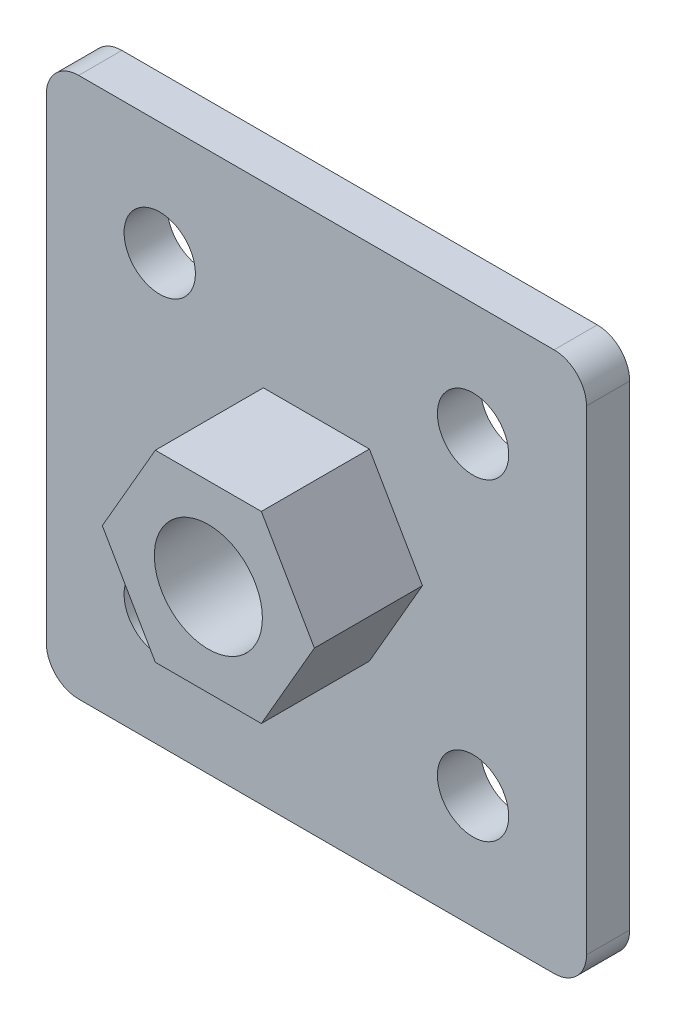
ISO-10303-21;
HEADER;
FILE_DESCRIPTION(('STEP AP214'),'2;1');
FILE_NAME('part.step','',(''),(''),'','','');
FILE_SCHEMA(('AUTOMOTIVE_DESIGN { 1 0 10303 214 1 1 1 1 }'));
ENDSEC;
DATA;
#1=APPLICATION_CONTEXT('core data for automotive mechanical design processes');
#2=APPLICATION_PROTOCOL_DEFINITION('international standard','automotive_design',2000,#1);
#3=PRODUCT_CONTEXT('',#1,'mechanical');
#4=PRODUCT('Part','Part','',(#3));
#5=PRODUCT_RELATED_PRODUCT_CATEGORY('part','',(#4));
#6=PRODUCT_DEFINITION_FORMATION('','',#4);
#7=PRODUCT_DEFINITION_CONTEXT('part definition',#1,'design');
#8=PRODUCT_DEFINITION('design','',#6,#7);
#9=PRODUCT_DEFINITION_SHAPE('','',#8);
#10=(LENGTH_UNIT() NAMED_UNIT(*) SI_UNIT(.MILLI.,.METRE.));
#11=(NAMED_UNIT(*) PLANE_ANGLE_UNIT() SI_UNIT($,.RADIAN.));
#12=(NAMED_UNIT(*) SI_UNIT($,.STERADIAN.) SOLID_ANGLE_UNIT());
#13=UNCERTAINTY_MEASURE_WITH_UNIT(LENGTH_MEASURE(1.E-05),#10,'distance_accuracy_value','');
#14=(GEOMETRIC_REPRESENTATION_CONTEXT(3) GLOBAL_UNCERTAINTY_ASSIGNED_CONTEXT((#13)) GLOBAL_UNIT_ASSIGNED_CONTEXT((#10,
#11,#12)) REPRESENTATION_CONTEXT('',''));
#15=CARTESIAN_POINT('',(0.,0.,0.));
#16=DIRECTION('',(0.,0.,1.));
#17=DIRECTION('',(1.,0.,0.));
#18=AXIS2_PLACEMENT_3D('',#15,#16,#17);
#19=CARTESIAN_POINT('',(0.,0.,4.));
#20=DIRECTION('',(0.,0.,-1.));
#21=DIRECTION('',(-1.,0.,0.));
#22=AXIS2_PLACEMENT_3D('',#19,#20,#21);
#23=PLANE('',#22);
#24=DIRECTION('',(-1.,0.,0.));
#25=VECTOR('',#24,1.);
#26=CARTESIAN_POINT('',(-25.,25.,4.));
#27=LINE('',#26,#25);
#28=CARTESIAN_POINT('',(22.,25.,4.));
#29=VERTEX_POINT('',#28);
#30=CARTESIAN_POINT('',(-22.,25.,4.));
#31=VERTEX_POINT('',#30);
#32=EDGE_CURVE('E217',#29,#31,#27,.T.);
#33=ORIENTED_EDGE('',*,*,#32,.T.);
#34=CARTESIAN_POINT('',(-22.,22.,4.));
#35=DIRECTION('',(0.,0.,-1.));
#36=DIRECTION('',(-1.,0.,0.));
#37=AXIS2_PLACEMENT_3D('',#34,#35,#36);
#38=CIRCLE('',#37,3.);
#39=CARTESIAN_POINT('',(-25.,22.,4.));
#40=VERTEX_POINT('',#39);
#41=EDGE_CURVE('E279',#31,#40,#38,.F.);
#42=ORIENTED_EDGE('',*,*,#41,.T.);
#43=DIRECTION('',(0.,-1.,0.));
#44=VECTOR('',#43,1.);
#45=CARTESIAN_POINT('',(-25.,-25.,4.));
#46=LINE('',#45,#44);
#47=CARTESIAN_POINT('',(-25.,-22.,4.));
#48=VERTEX_POINT('',#47);
#49=EDGE_CURVE('E222',#40,#48,#46,.T.);
#50=ORIENTED_EDGE('',*,*,#49,.T.);
#51=CARTESIAN_POINT('',(-22.,-22.,4.));
#52=DIRECTION('',(0.,0.,-1.));
#53=DIRECTION('',(-1.,0.,0.));
#54=AXIS2_PLACEMENT_3D('',#51,#52,#53);
#55=CIRCLE('',#54,3.);
#56=CARTESIAN_POINT('',(-22.,-25.,4.));
#57=VERTEX_POINT('',#56);
#58=EDGE_CURVE('E273',#48,#57,#55,.F.);
#59=ORIENTED_EDGE('',*,*,#58,.T.);
#60=DIRECTION('',(1.,0.,0.));
#61=VECTOR('',#60,1.);
#62=CARTESIAN_POINT('',(-25.,-25.,4.));
#63=LINE('',#62,#61);
#64=CARTESIAN_POINT('',(22.,-25.,4.));
#65=VERTEX_POINT('',#64);
#66=EDGE_CURVE('E226',#57,#65,#63,.T.);
#67=ORIENTED_EDGE('',*,*,#66,.T.);
#68=CARTESIAN_POINT('',(22.,-22.,4.));
#69=DIRECTION('',(0.,0.,-1.));
#70=DIRECTION('',(-1.,0.,0.));
#71=AXIS2_PLACEMENT_3D('',#68,#69,#70);
#72=CIRCLE('',#71,3.);
#73=CARTESIAN_POINT('',(25.,-22.,4.));
#74=VERTEX_POINT('',#73);
#75=EDGE_CURVE('E270',#65,#74,#72,.F.);
#76=ORIENTED_EDGE('',*,*,#75,.T.);
#77=DIRECTION('',(0.,1.,0.));
#78=VECTOR('',#77,1.);
#79=CARTESIAN_POINT('',(25.,-25.,4.));
#80=LINE('',#79,#78);
#81=CARTESIAN_POINT('',(25.,22.,4.));
#82=VERTEX_POINT('',#81);
#83=EDGE_CURVE('E213',#74,#82,#80,.T.);
#84=ORIENTED_EDGE('',*,*,#83,.T.);
#85=CARTESIAN_POINT('',(22.,22.,4.));
#86=DIRECTION('',(0.,0.,-1.));
#87=DIRECTION('',(-1.,0.,0.));
#88=AXIS2_PLACEMENT_3D('',#85,#86,#87);
#89=CIRCLE('',#88,3.);
#90=EDGE_CURVE('E276',#82,#29,#89,.F.);
#91=ORIENTED_EDGE('',*,*,#90,.T.);
#92=EDGE_LOOP('',(#33,#42,#50,#59,#67,#76,#84,#91));
#93=FACE_BOUND('',#92,.T.);
#94=CARTESIAN_POINT('',(-14.5,-14.5,4.));
#95=DIRECTION('',(0.,0.,-1.));
#96=DIRECTION('',(0.,1.,0.));
#97=AXIS2_PLACEMENT_3D('',#94,#95,#96);
#98=CIRCLE('',#97,3.3);
#99=CARTESIAN_POINT('',(-14.5,-11.2,4.));
#100=VERTEX_POINT('',#99);
#101=EDGE_CURVE('E204',#100,#100,#98,.T.);
#102=ORIENTED_EDGE('',*,*,#101,.T.);
#103=EDGE_LOOP('',(#102));
#104=FACE_BOUND('',#103,.T.);
#105=CARTESIAN_POINT('',(14.5,-14.5,4.));
#106=DIRECTION('',(0.,0.,-1.));
#107=DIRECTION('',(0.,1.,0.));
#108=AXIS2_PLACEMENT_3D('',#105,#106,#107);
#109=CIRCLE('',#108,3.3);
#110=CARTESIAN_POINT('',(14.5,-11.2,4.));
#111=VERTEX_POINT('',#110);
#112=EDGE_CURVE('E196',#111,#111,#109,.T.);
#113=ORIENTED_EDGE('',*,*,#112,.T.);
#114=EDGE_LOOP('',(#113));
#115=FACE_BOUND('',#114,.T.);
#116=CARTESIAN_POINT('',(-14.5,14.5,4.));
#117=DIRECTION('',(0.,0.,-1.));
#118=DIRECTION('',(0.,1.,0.));
#119=AXIS2_PLACEMENT_3D('',#116,#117,#118);
#120=CIRCLE('',#119,3.3);
#121=CARTESIAN_POINT('',(-14.5,17.8,4.));
#122=VERTEX_POINT('',#121);
#123=EDGE_CURVE('E188',#122,#122,#120,.T.);
#124=ORIENTED_EDGE('',*,*,#123,.T.);
#125=EDGE_LOOP('',(#124));
#126=FACE_BOUND('',#125,.T.);
#127=CARTESIAN_POINT('',(14.5,14.5,4.));
#128=DIRECTION('',(0.,0.,-1.));
#129=DIRECTION('',(0.,1.,0.));
#130=AXIS2_PLACEMENT_3D('',#127,#128,#129);
#131=CIRCLE('',#130,3.3);
#132=CARTESIAN_POINT('',(14.5,17.8,4.));
#133=VERTEX_POINT('',#132);
#134=EDGE_CURVE('E180',#133,#133,#131,.T.);
#135=ORIENTED_EDGE('',*,*,#134,.T.);
#136=EDGE_LOOP('',(#135));
#137=FACE_BOUND('',#136,.T.);
#138=DIRECTION('',(1.,0.,0.));
#139=VECTOR('',#138,1.);
#140=CARTESIAN_POINT('',(-4.90747728811182,-8.5,4.));
#141=LINE('',#140,#139);
#142=CARTESIAN_POINT('',(-4.90747728811182,-8.5,4.));
#143=VERTEX_POINT('',#142);
#144=CARTESIAN_POINT('',(4.90747728811182,-8.5,4.));
#145=VERTEX_POINT('',#144);
#146=EDGE_CURVE('E164',#143,#145,#141,.T.);
#147=ORIENTED_EDGE('',*,*,#146,.F.);
#148=DIRECTION('',(0.5,-0.866025403784438,0.));
#149=VECTOR('',#148,1.);
#150=CARTESIAN_POINT('',(-9.81495457622364,0.,4.));
#151=LINE('',#150,#149);
#152=CARTESIAN_POINT('',(-9.81495457622364,0.,4.));
#153=VERTEX_POINT('',#152);
#154=EDGE_CURVE('E161',#153,#143,#151,.T.);
#155=ORIENTED_EDGE('',*,*,#154,.F.);
#156=DIRECTION('',(-0.5,-0.866025403784439,0.));
#157=VECTOR('',#156,1.);
#158=CARTESIAN_POINT('',(-4.90747728811182,8.50000000000001,4.));
#159=LINE('',#158,#157);
#160=CARTESIAN_POINT('',(-4.90747728811182,8.50000000000001,4.));
#161=VERTEX_POINT('',#160);
#162=EDGE_CURVE('E433',#161,#153,#159,.T.);
#163=ORIENTED_EDGE('',*,*,#162,.F.);
#164=DIRECTION('',(-1.,0.,0.));
#165=VECTOR('',#164,1.);
#166=CARTESIAN_POINT('',(4.90747728811182,8.50000000000001,4.));
#167=LINE('',#166,#165);
#168=CARTESIAN_POINT('',(4.90747728811182,8.50000000000001,4.));
#169=VERTEX_POINT('',#168);
#170=EDGE_CURVE('E453',#169,#161,#167,.T.);
#171=ORIENTED_EDGE('',*,*,#170,.F.);
#172=DIRECTION('',(-0.5,0.866025403784438,0.));
#173=VECTOR('',#172,1.);
#174=CARTESIAN_POINT('',(9.81495457622364,0.,4.));
#175=LINE('',#174,#173);
#176=CARTESIAN_POINT('',(9.81495457622364,0.,4.));
#177=VERTEX_POINT('',#176);
#178=EDGE_CURVE('E60',#177,#169,#175,.T.);
#179=ORIENTED_EDGE('',*,*,#178,.F.);
#180=DIRECTION('',(0.5,0.866025403784439,0.));
#181=VECTOR('',#180,1.);
#182=CARTESIAN_POINT('',(4.90747728811182,-8.5,4.));
#183=LINE('',#182,#181);
#184=EDGE_CURVE('E55',#145,#177,#183,.T.);
#185=ORIENTED_EDGE('',*,*,#184,.F.);
#186=EDGE_LOOP('',(#147,#155,#163,#171,#179,#185));
#187=FACE_BOUND('',#186,.T.);
#188=ADVANCED_FACE('F39',(#93,#104,#115,#126,#137,#187),#23,.F.);
#189=CARTESIAN_POINT('',(25.,-25.,4.));
#190=DIRECTION('',(-1.,0.,0.));
#191=DIRECTION('',(0.,0.,1.));
#192=AXIS2_PLACEMENT_3D('',#189,#190,#191);
#193=PLANE('',#192);
#194=DIRECTION('',(0.,1.,0.));
#195=VECTOR('',#194,1.);
#196=CARTESIAN_POINT('',(25.,-25.,0.));
#197=LINE('',#196,#195);
#198=CARTESIAN_POINT('',(25.,-22.,0.));
#199=VERTEX_POINT('',#198);
#200=CARTESIAN_POINT('',(25.,22.,0.));
#201=VERTEX_POINT('',#200);
#202=EDGE_CURVE('E212',#199,#201,#197,.T.);
#203=ORIENTED_EDGE('',*,*,#202,.T.);
#204=DIRECTION('',(0.,0.,-1.));
#205=VECTOR('',#204,1.);
#206=CARTESIAN_POINT('',(25.,22.,4.));
#207=LINE('',#206,#205);
#208=EDGE_CURVE('E286',#201,#82,#207,.F.);
#209=ORIENTED_EDGE('',*,*,#208,.T.);
#210=ORIENTED_EDGE('',*,*,#83,.F.);
#211=DIRECTION('',(0.,0.,-1.));
#212=VECTOR('',#211,1.);
#213=CARTESIAN_POINT('',(25.,-22.,4.));
#214=LINE('',#213,#212);
#215=EDGE_CURVE('E282',#74,#199,#214,.T.);
#216=ORIENTED_EDGE('',*,*,#215,.T.);
#217=EDGE_LOOP('',(#203,#209,#210,#216));
#218=FACE_BOUND('',#217,.T.);
#219=ADVANCED_FACE('F304',(#218),#193,.F.);
#220=CARTESIAN_POINT('',(-25.,25.,4.));
#221=DIRECTION('',(0.,-1.,0.));
#222=DIRECTION('',(0.,0.,-1.));
#223=AXIS2_PLACEMENT_3D('',#220,#221,#222);
#224=PLANE('',#223);
#225=DIRECTION('',(-1.,0.,0.));
#226=VECTOR('',#225,1.);
#227=CARTESIAN_POINT('',(-25.,25.,0.));
#228=LINE('',#227,#226);
#229=CARTESIAN_POINT('',(22.,25.,0.));
#230=VERTEX_POINT('',#229);
#231=CARTESIAN_POINT('',(-22.,25.,0.));
#232=VERTEX_POINT('',#231);
#233=EDGE_CURVE('E234',#230,#232,#228,.T.);
#234=ORIENTED_EDGE('',*,*,#233,.T.);
#235=DIRECTION('',(0.,0.,-1.));
#236=VECTOR('',#235,1.);
#237=CARTESIAN_POINT('',(-22.,25.,4.));
#238=LINE('',#237,#236);
#239=EDGE_CURVE('E267',#232,#31,#238,.F.);
#240=ORIENTED_EDGE('',*,*,#239,.T.);
#241=ORIENTED_EDGE('',*,*,#32,.F.);
#242=DIRECTION('',(0.,0.,-1.));
#243=VECTOR('',#242,1.);
#244=CARTESIAN_POINT('',(22.,25.,4.));
#245=LINE('',#244,#243);
#246=EDGE_CURVE('E263',#29,#230,#245,.T.);
#247=ORIENTED_EDGE('',*,*,#246,.T.);
#248=EDGE_LOOP('',(#234,#240,#241,#247));
#249=FACE_BOUND('',#248,.T.);
#250=ADVANCED_FACE('F316',(#249),#224,.F.);
#251=CARTESIAN_POINT('',(-25.,-25.,4.));
#252=DIRECTION('',(1.,0.,0.));
#253=DIRECTION('',(0.,0.,-1.));
#254=AXIS2_PLACEMENT_3D('',#251,#252,#253);
#255=PLANE('',#254);
#256=ORIENTED_EDGE('',*,*,#49,.F.);
#257=DIRECTION('',(0.,0.,-1.));
#258=VECTOR('',#257,1.);
#259=CARTESIAN_POINT('',(-25.,22.,4.));
#260=LINE('',#259,#258);
#261=CARTESIAN_POINT('',(-25.,22.,0.));
#262=VERTEX_POINT('',#261);
#263=EDGE_CURVE('E247',#40,#262,#260,.T.);
#264=ORIENTED_EDGE('',*,*,#263,.T.);
#265=DIRECTION('',(0.,-1.,0.));
#266=VECTOR('',#265,1.);
#267=CARTESIAN_POINT('',(-25.,-25.,0.));
#268=LINE('',#267,#266);
#269=CARTESIAN_POINT('',(-25.,-22.,0.));
#270=VERTEX_POINT('',#269);
#271=EDGE_CURVE('E238',#262,#270,#268,.T.);
#272=ORIENTED_EDGE('',*,*,#271,.T.);
#273=DIRECTION('',(0.,0.,-1.));
#274=VECTOR('',#273,1.);
#275=CARTESIAN_POINT('',(-25.,-22.,4.));
#276=LINE('',#275,#274);
#277=EDGE_CURVE('E230',#270,#48,#276,.F.);
#278=ORIENTED_EDGE('',*,*,#277,.T.);
#279=EDGE_LOOP('',(#256,#264,#272,#278));
#280=FACE_BOUND('',#279,.T.);
#281=ADVANCED_FACE('F324',(#280),#255,.F.);
#282=CARTESIAN_POINT('',(-25.,-25.,4.));
#283=DIRECTION('',(0.,1.,0.));
#284=DIRECTION('',(0.,0.,1.));
#285=AXIS2_PLACEMENT_3D('',#282,#283,#284);
#286=PLANE('',#285);
#287=ORIENTED_EDGE('',*,*,#66,.F.);
#288=DIRECTION('',(0.,0.,-1.));
#289=VECTOR('',#288,1.);
#290=CARTESIAN_POINT('',(-22.,-25.,4.));
#291=LINE('',#290,#289);
#292=CARTESIAN_POINT('',(-22.,-25.,0.));
#293=VERTEX_POINT('',#292);
#294=EDGE_CURVE('E11',#57,#293,#291,.T.);
#295=ORIENTED_EDGE('',*,*,#294,.T.);
#296=DIRECTION('',(1.,0.,0.));
#297=VECTOR('',#296,1.);
#298=CARTESIAN_POINT('',(-25.,-25.,0.));
#299=LINE('',#298,#297);
#300=CARTESIAN_POINT('',(22.,-25.,0.));
#301=VERTEX_POINT('',#300);
#302=EDGE_CURVE('E218',#293,#301,#299,.T.);
#303=ORIENTED_EDGE('',*,*,#302,.T.);
#304=DIRECTION('',(0.,0.,-1.));
#305=VECTOR('',#304,1.);
#306=CARTESIAN_POINT('',(22.,-25.,4.));
#307=LINE('',#306,#305);
#308=EDGE_CURVE('E48',#301,#65,#307,.F.);
#309=ORIENTED_EDGE('',*,*,#308,.T.);
#310=EDGE_LOOP('',(#287,#295,#303,#309));
#311=FACE_BOUND('',#310,.T.);
#312=ADVANCED_FACE('F292',(#311),#286,.F.);
#313=CARTESIAN_POINT('',(0.,0.,0.));
#314=DIRECTION('',(0.,0.,-1.));
#315=DIRECTION('',(-1.,0.,0.));
#316=AXIS2_PLACEMENT_3D('',#313,#314,#315);
#317=PLANE('',#316);
#318=CARTESIAN_POINT('',(14.5,14.5,0.));
#319=DIRECTION('',(0.,0.,-1.));
#320=DIRECTION('',(0.,1.,0.));
#321=AXIS2_PLACEMENT_3D('',#318,#319,#320);
#322=CIRCLE('',#321,3.3);
#323=CARTESIAN_POINT('',(14.5,17.8,0.));
#324=VERTEX_POINT('',#323);
#325=EDGE_CURVE('E171',#324,#324,#322,.T.);
#326=ORIENTED_EDGE('',*,*,#325,.F.);
#327=EDGE_LOOP('',(#326));
#328=FACE_BOUND('',#327,.T.);
#329=CARTESIAN_POINT('',(-14.5,14.5,0.));
#330=DIRECTION('',(0.,0.,-1.));
#331=DIRECTION('',(0.,1.,0.));
#332=AXIS2_PLACEMENT_3D('',#329,#330,#331);
#333=CIRCLE('',#332,3.3);
#334=CARTESIAN_POINT('',(-14.5,17.8,0.));
#335=VERTEX_POINT('',#334);
#336=EDGE_CURVE('E184',#335,#335,#333,.T.);
#337=ORIENTED_EDGE('',*,*,#336,.F.);
#338=EDGE_LOOP('',(#337));
#339=FACE_BOUND('',#338,.T.);
#340=CARTESIAN_POINT('',(14.5,-14.5,0.));
#341=DIRECTION('',(0.,0.,-1.));
#342=DIRECTION('',(0.,1.,0.));
#343=AXIS2_PLACEMENT_3D('',#340,#341,#342);
#344=CIRCLE('',#343,3.3);
#345=CARTESIAN_POINT('',(14.5,-11.2,0.));
#346=VERTEX_POINT('',#345);
#347=EDGE_CURVE('E192',#346,#346,#344,.T.);
#348=ORIENTED_EDGE('',*,*,#347,.F.);
#349=EDGE_LOOP('',(#348));
#350=FACE_BOUND('',#349,.T.);
#351=CARTESIAN_POINT('',(-14.5,-14.5,0.));
#352=DIRECTION('',(0.,0.,-1.));
#353=DIRECTION('',(0.,1.,0.));
#354=AXIS2_PLACEMENT_3D('',#351,#352,#353);
#355=CIRCLE('',#354,3.3);
#356=CARTESIAN_POINT('',(-14.5,-11.2,0.));
#357=VERTEX_POINT('',#356);
#358=EDGE_CURVE('E200',#357,#357,#355,.T.);
#359=ORIENTED_EDGE('',*,*,#358,.F.);
#360=EDGE_LOOP('',(#359));
#361=FACE_BOUND('',#360,.T.);
#362=CARTESIAN_POINT('',(0.,0.,0.));
#363=DIRECTION('',(0.,0.,1.));
#364=DIRECTION('',(1.,0.,0.));
#365=AXIS2_PLACEMENT_3D('',#362,#363,#364);
#366=CIRCLE('',#365,5.5);
#367=CARTESIAN_POINT('',(5.5,0.,0.));
#368=VERTEX_POINT('',#367);
#369=EDGE_CURVE('E208',#368,#368,#366,.T.);
#370=ORIENTED_EDGE('',*,*,#369,.T.);
#371=EDGE_LOOP('',(#370));
#372=FACE_BOUND('',#371,.T.);
#373=ORIENTED_EDGE('',*,*,#271,.F.);
#374=CARTESIAN_POINT('',(-22.,22.,0.));
#375=DIRECTION('',(0.,0.,-1.));
#376=DIRECTION('',(-1.,0.,0.));
#377=AXIS2_PLACEMENT_3D('',#374,#375,#376);
#378=CIRCLE('',#377,3.);
#379=EDGE_CURVE('E260',#262,#232,#378,.T.);
#380=ORIENTED_EDGE('',*,*,#379,.T.);
#381=ORIENTED_EDGE('',*,*,#233,.F.);
#382=CARTESIAN_POINT('',(22.,22.,0.));
#383=DIRECTION('',(0.,0.,-1.));
#384=DIRECTION('',(-1.,0.,0.));
#385=AXIS2_PLACEMENT_3D('',#382,#383,#384);
#386=CIRCLE('',#385,3.);
#387=EDGE_CURVE('E257',#230,#201,#386,.T.);
#388=ORIENTED_EDGE('',*,*,#387,.T.);
#389=ORIENTED_EDGE('',*,*,#202,.F.);
#390=CARTESIAN_POINT('',(22.,-22.,0.));
#391=DIRECTION('',(0.,0.,-1.));
#392=DIRECTION('',(-1.,0.,0.));
#393=AXIS2_PLACEMENT_3D('',#390,#391,#392);
#394=CIRCLE('',#393,3.);
#395=EDGE_CURVE('E251',#199,#301,#394,.T.);
#396=ORIENTED_EDGE('',*,*,#395,.T.);
#397=ORIENTED_EDGE('',*,*,#302,.F.);
#398=CARTESIAN_POINT('',(-22.,-22.,0.));
#399=DIRECTION('',(0.,0.,-1.));
#400=DIRECTION('',(-1.,0.,0.));
#401=AXIS2_PLACEMENT_3D('',#398,#399,#400);
#402=CIRCLE('',#401,3.);
#403=EDGE_CURVE('E254',#293,#270,#402,.T.);
#404=ORIENTED_EDGE('',*,*,#403,.T.);
#405=EDGE_LOOP('',(#373,#380,#381,#388,#389,#396,#397,#404));
#406=FACE_BOUND('',#405,.T.);
#407=ADVANCED_FACE('F308',(#328,#339,#350,#361,#372,#406),#317,.T.);
#408=CARTESIAN_POINT('',(0.,0.,4.));
#409=DIRECTION('',(0.,0.,1.));
#410=DIRECTION('',(1.,0.,0.));
#411=AXIS2_PLACEMENT_3D('',#408,#409,#410);
#412=CYLINDRICAL_SURFACE('',#411,5.5);
#413=ORIENTED_EDGE('',*,*,#369,.F.);
#414=EDGE_LOOP('',(#413));
#415=FACE_BOUND('',#414,.T.);
#416=CARTESIAN_POINT('',(0.,0.,4.));
#417=DIRECTION('',(0.,0.,1.));
#418=DIRECTION('',(1.,0.,0.));
#419=AXIS2_PLACEMENT_3D('',#416,#417,#418);
#420=CIRCLE('',#419,5.5);
#421=CARTESIAN_POINT('',(5.5,0.,4.));
#422=VERTEX_POINT('',#421);
#423=EDGE_CURVE('E166',#422,#422,#420,.F.);
#424=ORIENTED_EDGE('',*,*,#423,.F.);
#425=EDGE_LOOP('',(#424));
#426=FACE_BOUND('',#425,.T.);
#427=ADVANCED_FACE('F343',(#415,#426),#412,.F.);
#428=CARTESIAN_POINT('',(-22.,22.,4.));
#429=DIRECTION('',(0.,0.,-1.));
#430=DIRECTION('',(-1.,0.,0.));
#431=AXIS2_PLACEMENT_3D('',#428,#429,#430);
#432=CYLINDRICAL_SURFACE('',#431,3.);
#433=ORIENTED_EDGE('',*,*,#41,.F.);
#434=ORIENTED_EDGE('',*,*,#239,.F.);
#435=ORIENTED_EDGE('',*,*,#379,.F.);
#436=ORIENTED_EDGE('',*,*,#263,.F.);
#437=EDGE_LOOP('',(#433,#434,#435,#436));
#438=FACE_BOUND('',#437,.T.);
#439=ADVANCED_FACE('F322',(#438),#432,.T.);
#440=CARTESIAN_POINT('',(22.,22.,4.));
#441=DIRECTION('',(0.,0.,-1.));
#442=DIRECTION('',(-1.,0.,0.));
#443=AXIS2_PLACEMENT_3D('',#440,#441,#442);
#444=CYLINDRICAL_SURFACE('',#443,3.);
#445=ORIENTED_EDGE('',*,*,#90,.F.);
#446=ORIENTED_EDGE('',*,*,#208,.F.);
#447=ORIENTED_EDGE('',*,*,#387,.F.);
#448=ORIENTED_EDGE('',*,*,#246,.F.);
#449=EDGE_LOOP('',(#445,#446,#447,#448));
#450=FACE_BOUND('',#449,.T.);
#451=ADVANCED_FACE('F313',(#450),#444,.T.);
#452=CARTESIAN_POINT('',(-22.,-22.,4.));
#453=DIRECTION('',(0.,0.,-1.));
#454=DIRECTION('',(-1.,0.,0.));
#455=AXIS2_PLACEMENT_3D('',#452,#453,#454);
#456=CYLINDRICAL_SURFACE('',#455,3.);
#457=ORIENTED_EDGE('',*,*,#58,.F.);
#458=ORIENTED_EDGE('',*,*,#277,.F.);
#459=ORIENTED_EDGE('',*,*,#403,.F.);
#460=ORIENTED_EDGE('',*,*,#294,.F.);
#461=EDGE_LOOP('',(#457,#458,#459,#460));
#462=FACE_BOUND('',#461,.T.);
#463=ADVANCED_FACE('F327',(#462),#456,.T.);
#464=CARTESIAN_POINT('',(22.,-22.,4.));
#465=DIRECTION('',(0.,0.,-1.));
#466=DIRECTION('',(-1.,0.,0.));
#467=AXIS2_PLACEMENT_3D('',#464,#465,#466);
#468=CYLINDRICAL_SURFACE('',#467,3.);
#469=ORIENTED_EDGE('',*,*,#75,.F.);
#470=ORIENTED_EDGE('',*,*,#308,.F.);
#471=ORIENTED_EDGE('',*,*,#395,.F.);
#472=ORIENTED_EDGE('',*,*,#215,.F.);
#473=EDGE_LOOP('',(#469,#470,#471,#472));
#474=FACE_BOUND('',#473,.T.);
#475=ADVANCED_FACE('F41',(#474),#468,.T.);
#476=CARTESIAN_POINT('',(-14.5,-14.5,0.));
#477=DIRECTION('',(0.,0.,-1.));
#478=DIRECTION('',(0.,1.,0.));
#479=AXIS2_PLACEMENT_3D('',#476,#477,#478);
#480=CYLINDRICAL_SURFACE('',#479,3.3);
#481=ORIENTED_EDGE('',*,*,#101,.F.);
#482=EDGE_LOOP('',(#481));
#483=FACE_BOUND('',#482,.T.);
#484=ORIENTED_EDGE('',*,*,#358,.T.);
#485=EDGE_LOOP('',(#484));
#486=FACE_BOUND('',#485,.T.);
#487=ADVANCED_FACE('F333',(#483,#486),#480,.F.);
#488=CARTESIAN_POINT('',(14.5,-14.5,0.));
#489=DIRECTION('',(0.,0.,-1.));
#490=DIRECTION('',(0.,1.,0.));
#491=AXIS2_PLACEMENT_3D('',#488,#489,#490);
#492=CYLINDRICAL_SURFACE('',#491,3.3);
#493=ORIENTED_EDGE('',*,*,#112,.F.);
#494=EDGE_LOOP('',(#493));
#495=FACE_BOUND('',#494,.T.);
#496=ORIENTED_EDGE('',*,*,#347,.T.);
#497=EDGE_LOOP('',(#496));
#498=FACE_BOUND('',#497,.T.);
#499=ADVANCED_FACE('F404',(#495,#498),#492,.F.);
#500=CARTESIAN_POINT('',(-14.5,14.5,0.));
#501=DIRECTION('',(0.,0.,-1.));
#502=DIRECTION('',(0.,1.,0.));
#503=AXIS2_PLACEMENT_3D('',#500,#501,#502);
#504=CYLINDRICAL_SURFACE('',#503,3.3);
#505=ORIENTED_EDGE('',*,*,#123,.F.);
#506=EDGE_LOOP('',(#505));
#507=FACE_BOUND('',#506,.T.);
#508=ORIENTED_EDGE('',*,*,#336,.T.);
#509=EDGE_LOOP('',(#508));
#510=FACE_BOUND('',#509,.T.);
#511=ADVANCED_FACE('F375',(#507,#510),#504,.F.);
#512=CARTESIAN_POINT('',(14.5,14.5,0.));
#513=DIRECTION('',(0.,0.,-1.));
#514=DIRECTION('',(0.,1.,0.));
#515=AXIS2_PLACEMENT_3D('',#512,#513,#514);
#516=CYLINDRICAL_SURFACE('',#515,3.3);
#517=ORIENTED_EDGE('',*,*,#134,.F.);
#518=EDGE_LOOP('',(#517));
#519=FACE_BOUND('',#518,.T.);
#520=ORIENTED_EDGE('',*,*,#325,.T.);
#521=EDGE_LOOP('',(#520));
#522=FACE_BOUND('',#521,.T.);
#523=ADVANCED_FACE('F367',(#519,#522),#516,.F.);
#524=CARTESIAN_POINT('',(0.,0.,4.));
#525=DIRECTION('',(0.,0.,1.));
#526=DIRECTION('',(1.,0.,0.));
#527=AXIS2_PLACEMENT_3D('',#524,#525,#526);
#528=PLANE('',#527);
#529=CARTESIAN_POINT('',(0.,0.,4.));
#530=DIRECTION('',(0.,0.,1.));
#531=DIRECTION('',(1.,0.,0.));
#532=AXIS2_PLACEMENT_3D('',#529,#530,#531);
#533=CIRCLE('',#532,5.);
#534=CARTESIAN_POINT('',(5.,0.,4.));
#535=VERTEX_POINT('',#534);
#536=EDGE_CURVE('E470',#535,#535,#533,.T.);
#537=ORIENTED_EDGE('',*,*,#536,.T.);
#538=EDGE_LOOP('',(#537));
#539=FACE_BOUND('',#538,.T.);
#540=ORIENTED_EDGE('',*,*,#423,.T.);
#541=EDGE_LOOP('',(#540));
#542=FACE_BOUND('',#541,.T.);
#543=ADVANCED_FACE('F365',(#539,#542),#528,.F.);
#544=CARTESIAN_POINT('',(0.,0.,14.));
#545=DIRECTION('',(0.,0.,1.));
#546=DIRECTION('',(1.,0.,0.));
#547=AXIS2_PLACEMENT_3D('',#544,#545,#546);
#548=PLANE('',#547);
#549=DIRECTION('',(1.,0.,0.));
#550=VECTOR('',#549,1.);
#551=CARTESIAN_POINT('',(-4.90747728811182,-8.5,14.));
#552=LINE('',#551,#550);
#553=CARTESIAN_POINT('',(-4.90747728811182,-8.5,14.));
#554=VERTEX_POINT('',#553);
#555=CARTESIAN_POINT('',(4.90747728811182,-8.5,14.));
#556=VERTEX_POINT('',#555);
#557=EDGE_CURVE('E150',#554,#556,#552,.T.);
#558=ORIENTED_EDGE('',*,*,#557,.T.);
#559=DIRECTION('',(0.5,0.866025403784439,0.));
#560=VECTOR('',#559,1.);
#561=CARTESIAN_POINT('',(4.90747728811182,-8.5,14.));
#562=LINE('',#561,#560);
#563=CARTESIAN_POINT('',(9.81495457622364,0.,14.));
#564=VERTEX_POINT('',#563);
#565=EDGE_CURVE('E138',#556,#564,#562,.T.);
#566=ORIENTED_EDGE('',*,*,#565,.T.);
#567=DIRECTION('',(-0.5,0.866025403784438,0.));
#568=VECTOR('',#567,1.);
#569=CARTESIAN_POINT('',(9.81495457622364,0.,14.));
#570=LINE('',#569,#568);
#571=CARTESIAN_POINT('',(4.90747728811182,8.50000000000001,14.));
#572=VERTEX_POINT('',#571);
#573=EDGE_CURVE('E149',#564,#572,#570,.T.);
#574=ORIENTED_EDGE('',*,*,#573,.T.);
#575=DIRECTION('',(-1.,0.,0.));
#576=VECTOR('',#575,1.);
#577=CARTESIAN_POINT('',(4.90747728811182,8.50000000000001,14.));
#578=LINE('',#577,#576);
#579=CARTESIAN_POINT('',(-4.90747728811182,8.50000000000001,14.));
#580=VERTEX_POINT('',#579);
#581=EDGE_CURVE('E454',#572,#580,#578,.T.);
#582=ORIENTED_EDGE('',*,*,#581,.T.);
#583=DIRECTION('',(-0.5,-0.866025403784439,0.));
#584=VECTOR('',#583,1.);
#585=CARTESIAN_POINT('',(-4.90747728811182,8.50000000000001,14.));
#586=LINE('',#585,#584);
#587=CARTESIAN_POINT('',(-9.81495457622364,0.,14.));
#588=VERTEX_POINT('',#587);
#589=EDGE_CURVE('E441',#580,#588,#586,.T.);
#590=ORIENTED_EDGE('',*,*,#589,.T.);
#591=DIRECTION('',(0.5,-0.866025403784438,0.));
#592=VECTOR('',#591,1.);
#593=CARTESIAN_POINT('',(-9.81495457622364,0.,14.));
#594=LINE('',#593,#592);
#595=EDGE_CURVE('E156',#588,#554,#594,.T.);
#596=ORIENTED_EDGE('',*,*,#595,.T.);
#597=EDGE_LOOP('',(#558,#566,#574,#582,#590,#596));
#598=FACE_BOUND('',#597,.T.);
#599=CARTESIAN_POINT('',(0.,0.,14.));
#600=DIRECTION('',(0.,0.,1.));
#601=DIRECTION('',(1.,0.,0.));
#602=AXIS2_PLACEMENT_3D('',#599,#600,#601);
#603=CIRCLE('',#602,5.);
#604=CARTESIAN_POINT('',(5.,0.,14.));
#605=VERTEX_POINT('',#604);
#606=EDGE_CURVE('E426',#605,#605,#603,.T.);
#607=ORIENTED_EDGE('',*,*,#606,.F.);
#608=EDGE_LOOP('',(#607));
#609=FACE_BOUND('',#608,.T.);
#610=ADVANCED_FACE('F153',(#598,#609),#548,.T.);
#611=CARTESIAN_POINT('',(-4.90747728811182,-8.5,14.));
#612=DIRECTION('',(0.,1.,0.));
#613=DIRECTION('',(0.,0.,1.));
#614=AXIS2_PLACEMENT_3D('',#611,#612,#613);
#615=PLANE('',#614);
#616=ORIENTED_EDGE('',*,*,#146,.T.);
#617=DIRECTION('',(0.,0.,-1.));
#618=VECTOR('',#617,1.);
#619=CARTESIAN_POINT('',(4.90747728811182,-8.5,14.));
#620=LINE('',#619,#618);
#621=EDGE_CURVE('E142',#556,#145,#620,.T.);
#622=ORIENTED_EDGE('',*,*,#621,.F.);
#623=ORIENTED_EDGE('',*,*,#557,.F.);
#624=DIRECTION('',(0.,0.,-1.));
#625=VECTOR('',#624,1.);
#626=CARTESIAN_POINT('',(-4.90747728811182,-8.5,14.));
#627=LINE('',#626,#625);
#628=EDGE_CURVE('E429',#554,#143,#627,.T.);
#629=ORIENTED_EDGE('',*,*,#628,.T.);
#630=EDGE_LOOP('',(#616,#622,#623,#629));
#631=FACE_BOUND('',#630,.T.);
#632=ADVANCED_FACE('F163',(#631),#615,.F.);
#633=CARTESIAN_POINT('',(4.90747728811182,-8.5,14.));
#634=DIRECTION('',(-0.866025403784439,0.5,0.));
#635=DIRECTION('',(-0.5,-0.866025403784439,0.));
#636=AXIS2_PLACEMENT_3D('',#633,#634,#635);
#637=PLANE('',#636);
#638=ORIENTED_EDGE('',*,*,#184,.T.);
#639=DIRECTION('',(0.,0.,-1.));
#640=VECTOR('',#639,1.);
#641=CARTESIAN_POINT('',(9.81495457622364,0.,14.));
#642=LINE('',#641,#640);
#643=EDGE_CURVE('E145',#564,#177,#642,.T.);
#644=ORIENTED_EDGE('',*,*,#643,.F.);
#645=ORIENTED_EDGE('',*,*,#565,.F.);
#646=ORIENTED_EDGE('',*,*,#621,.T.);
#647=EDGE_LOOP('',(#638,#644,#645,#646));
#648=FACE_BOUND('',#647,.T.);
#649=ADVANCED_FACE('F140',(#648),#637,.F.);
#650=CARTESIAN_POINT('',(9.81495457622364,0.,14.));
#651=DIRECTION('',(-0.866025403784438,-0.5,0.));
#652=DIRECTION('',(0.5,-0.866025403784439,0.));
#653=AXIS2_PLACEMENT_3D('',#650,#651,#652);
#654=PLANE('',#653);
#655=ORIENTED_EDGE('',*,*,#178,.T.);
#656=DIRECTION('',(0.,0.,-1.));
#657=VECTOR('',#656,1.);
#658=CARTESIAN_POINT('',(4.90747728811182,8.50000000000001,14.));
#659=LINE('',#658,#657);
#660=EDGE_CURVE('E173',#572,#169,#659,.T.);
#661=ORIENTED_EDGE('',*,*,#660,.F.);
#662=ORIENTED_EDGE('',*,*,#573,.F.);
#663=ORIENTED_EDGE('',*,*,#643,.T.);
#664=EDGE_LOOP('',(#655,#661,#662,#663));
#665=FACE_BOUND('',#664,.T.);
#666=ADVANCED_FACE('F393',(#665),#654,.F.);
#667=CARTESIAN_POINT('',(4.90747728811182,8.50000000000001,14.));
#668=DIRECTION('',(0.,-1.,0.));
#669=DIRECTION('',(1.,0.,0.));
#670=AXIS2_PLACEMENT_3D('',#667,#668,#669);
#671=PLANE('',#670);
#672=ORIENTED_EDGE('',*,*,#170,.T.);
#673=DIRECTION('',(0.,0.,-1.));
#674=VECTOR('',#673,1.);
#675=CARTESIAN_POINT('',(-4.90747728811182,8.50000000000001,14.));
#676=LINE('',#675,#674);
#677=EDGE_CURVE('E439',#580,#161,#676,.T.);
#678=ORIENTED_EDGE('',*,*,#677,.F.);
#679=ORIENTED_EDGE('',*,*,#581,.F.);
#680=ORIENTED_EDGE('',*,*,#660,.T.);
#681=EDGE_LOOP('',(#672,#678,#679,#680));
#682=FACE_BOUND('',#681,.T.);
#683=ADVANCED_FACE('F389',(#682),#671,.F.);
#684=CARTESIAN_POINT('',(-4.90747728811182,8.50000000000001,14.));
#685=DIRECTION('',(0.866025403784439,-0.5,0.));
#686=DIRECTION('',(0.5,0.866025403784439,0.));
#687=AXIS2_PLACEMENT_3D('',#684,#685,#686);
#688=PLANE('',#687);
#689=ORIENTED_EDGE('',*,*,#162,.T.);
#690=DIRECTION('',(0.,0.,-1.));
#691=VECTOR('',#690,1.);
#692=CARTESIAN_POINT('',(-9.81495457622364,0.,14.));
#693=LINE('',#692,#691);
#694=EDGE_CURVE('E431',#588,#153,#693,.T.);
#695=ORIENTED_EDGE('',*,*,#694,.F.);
#696=ORIENTED_EDGE('',*,*,#589,.F.);
#697=ORIENTED_EDGE('',*,*,#677,.T.);
#698=EDGE_LOOP('',(#689,#695,#696,#697));
#699=FACE_BOUND('',#698,.T.);
#700=ADVANCED_FACE('F385',(#699),#688,.F.);
#701=CARTESIAN_POINT('',(-9.81495457622364,0.,14.));
#702=DIRECTION('',(0.866025403784438,0.5,0.));
#703=DIRECTION('',(-0.5,0.866025403784438,0.));
#704=AXIS2_PLACEMENT_3D('',#701,#702,#703);
#705=PLANE('',#704);
#706=ORIENTED_EDGE('',*,*,#154,.T.);
#707=ORIENTED_EDGE('',*,*,#628,.F.);
#708=ORIENTED_EDGE('',*,*,#595,.F.);
#709=ORIENTED_EDGE('',*,*,#694,.T.);
#710=EDGE_LOOP('',(#706,#707,#708,#709));
#711=FACE_BOUND('',#710,.T.);
#712=ADVANCED_FACE('F381',(#711),#705,.F.);
#713=CARTESIAN_POINT('',(0.,0.,14.));
#714=DIRECTION('',(0.,0.,-1.));
#715=DIRECTION('',(-1.,0.,0.));
#716=AXIS2_PLACEMENT_3D('',#713,#714,#715);
#717=CYLINDRICAL_SURFACE('',#716,5.);
#718=ORIENTED_EDGE('',*,*,#606,.T.);
#719=EDGE_LOOP('',(#718));
#720=FACE_BOUND('',#719,.T.);
#721=ORIENTED_EDGE('',*,*,#536,.F.);
#722=EDGE_LOOP('',(#721));
#723=FACE_BOUND('',#722,.T.);
#724=ADVANCED_FACE('F384',(#720,#723),#717,.F.);
#725=CLOSED_SHELL('',(#188,#219,#250,#281,#312,#407,#427,#439,#451,#463,#475,#487,#499,#511,
#523,#543,#610,#632,#649,#666,#683,#700,#712,#724));
#726=MANIFOLD_SOLID_BREP('B2',#725);
#727=ADVANCED_BREP_SHAPE_REPRESENTATION('',(#18,#726),#14);
#728=SHAPE_DEFINITION_REPRESENTATION(#9,#727);
ENDSEC;
END-ISO-10303-21;
